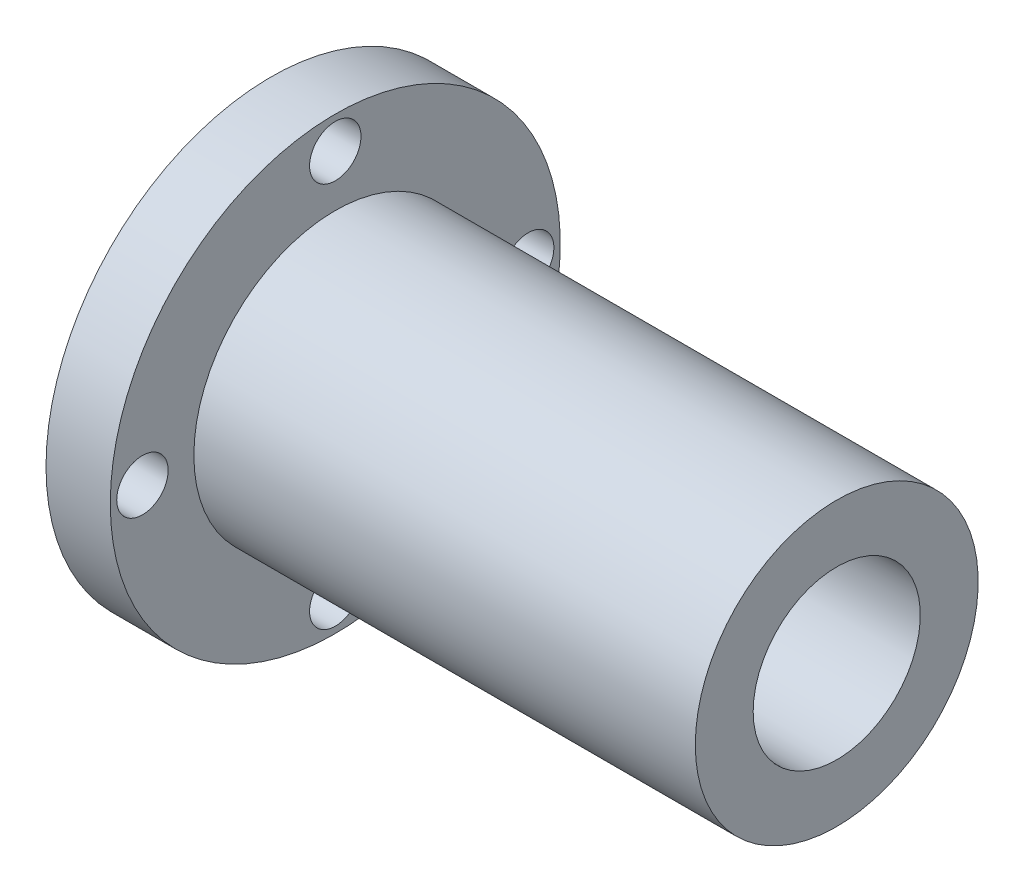
ISO-10303-21;
HEADER;
FILE_DESCRIPTION(('STEP AP214'),'2;1');
FILE_NAME('part.step','',(''),(''),'','','');
FILE_SCHEMA(('AUTOMOTIVE_DESIGN { 1 0 10303 214 1 1 1 1 }'));
ENDSEC;
DATA;
#1=APPLICATION_CONTEXT('core data for automotive mechanical design processes');
#2=APPLICATION_PROTOCOL_DEFINITION('international standard','automotive_design',2000,#1);
#3=PRODUCT_CONTEXT('',#1,'mechanical');
#4=PRODUCT('Part','Part','',(#3));
#5=PRODUCT_RELATED_PRODUCT_CATEGORY('part','',(#4));
#6=PRODUCT_DEFINITION_FORMATION('','',#4);
#7=PRODUCT_DEFINITION_CONTEXT('part definition',#1,'design');
#8=PRODUCT_DEFINITION('design','',#6,#7);
#9=PRODUCT_DEFINITION_SHAPE('','',#8);
#10=(LENGTH_UNIT() NAMED_UNIT(*) SI_UNIT(.MILLI.,.METRE.));
#11=(NAMED_UNIT(*) PLANE_ANGLE_UNIT() SI_UNIT($,.RADIAN.));
#12=(NAMED_UNIT(*) SI_UNIT($,.STERADIAN.) SOLID_ANGLE_UNIT());
#13=UNCERTAINTY_MEASURE_WITH_UNIT(LENGTH_MEASURE(1.E-05),#10,'distance_accuracy_value','');
#14=(GEOMETRIC_REPRESENTATION_CONTEXT(3) GLOBAL_UNCERTAINTY_ASSIGNED_CONTEXT((#13)) GLOBAL_UNIT_ASSIGNED_CONTEXT((#10,
#11,#12)) REPRESENTATION_CONTEXT('',''));
#15=CARTESIAN_POINT('',(0.,0.,0.));
#16=DIRECTION('',(0.,0.,1.));
#17=DIRECTION('',(1.,0.,0.));
#18=AXIS2_PLACEMENT_3D('',#15,#16,#17);
#19=CARTESIAN_POINT('',(0.,0.,0.));
#20=DIRECTION('',(-1.,0.,0.));
#21=DIRECTION('',(0.,0.,1.));
#22=AXIS2_PLACEMENT_3D('',#19,#20,#21);
#23=CYLINDRICAL_SURFACE('',#22,6.5);
#24=CARTESIAN_POINT('',(44.,0.,0.));
#25=DIRECTION('',(-1.,0.,0.));
#26=DIRECTION('',(0.,0.,1.));
#27=AXIS2_PLACEMENT_3D('',#24,#25,#26);
#28=CIRCLE('',#27,6.5);
#29=CARTESIAN_POINT('',(44.,0.,6.5));
#30=VERTEX_POINT('',#29);
#31=EDGE_CURVE('E10',#30,#30,#28,.T.);
#32=ORIENTED_EDGE('',*,*,#31,.F.);
#33=EDGE_LOOP('',(#32));
#34=FACE_BOUND('',#33,.T.);
#35=CARTESIAN_POINT('',(20.,0.,0.));
#36=DIRECTION('',(-1.,0.,0.));
#37=DIRECTION('',(0.,0.,1.));
#38=AXIS2_PLACEMENT_3D('',#35,#36,#37);
#39=CIRCLE('',#38,6.5);
#40=CARTESIAN_POINT('',(20.,0.,6.5));
#41=VERTEX_POINT('',#40);
#42=EDGE_CURVE('E56',#41,#41,#39,.T.);
#43=ORIENTED_EDGE('',*,*,#42,.T.);
#44=EDGE_LOOP('',(#43));
#45=FACE_BOUND('',#44,.T.);
#46=ADVANCED_FACE('F28',(#34,#45),#23,.F.);
#47=CARTESIAN_POINT('',(44.,6.5,0.));
#48=DIRECTION('',(-1.,0.,0.));
#49=DIRECTION('',(0.,0.,1.));
#50=AXIS2_PLACEMENT_3D('',#47,#48,#49);
#51=PLANE('',#50);
#52=CARTESIAN_POINT('',(44.,0.,0.));
#53=DIRECTION('',(-1.,0.,0.));
#54=DIRECTION('',(0.,0.,1.));
#55=AXIS2_PLACEMENT_3D('',#52,#53,#54);
#56=CIRCLE('',#55,11.);
#57=CARTESIAN_POINT('',(44.,0.,11.));
#58=VERTEX_POINT('',#57);
#59=EDGE_CURVE('E34',#58,#58,#56,.T.);
#60=ORIENTED_EDGE('',*,*,#59,.F.);
#61=EDGE_LOOP('',(#60));
#62=FACE_BOUND('',#61,.T.);
#63=ORIENTED_EDGE('',*,*,#31,.T.);
#64=EDGE_LOOP('',(#63));
#65=FACE_BOUND('',#64,.T.);
#66=ADVANCED_FACE('F117',(#62,#65),#51,.F.);
#67=CARTESIAN_POINT('',(0.,0.,0.));
#68=DIRECTION('',(-1.,0.,0.));
#69=DIRECTION('',(0.,0.,1.));
#70=AXIS2_PLACEMENT_3D('',#67,#68,#69);
#71=CYLINDRICAL_SURFACE('',#70,11.);
#72=CARTESIAN_POINT('',(5.,0.,0.));
#73=DIRECTION('',(-1.,0.,0.));
#74=DIRECTION('',(0.,0.,1.));
#75=AXIS2_PLACEMENT_3D('',#72,#73,#74);
#76=CIRCLE('',#75,11.);
#77=CARTESIAN_POINT('',(5.,0.,11.));
#78=VERTEX_POINT('',#77);
#79=EDGE_CURVE('E38',#78,#78,#76,.T.);
#80=ORIENTED_EDGE('',*,*,#79,.F.);
#81=EDGE_LOOP('',(#80));
#82=FACE_BOUND('',#81,.T.);
#83=ORIENTED_EDGE('',*,*,#59,.T.);
#84=EDGE_LOOP('',(#83));
#85=FACE_BOUND('',#84,.T.);
#86=ADVANCED_FACE('F111',(#82,#85),#71,.T.);
#87=CARTESIAN_POINT('',(5.,17.5,0.));
#88=DIRECTION('',(-1.,0.,0.));
#89=DIRECTION('',(0.,0.,1.));
#90=AXIS2_PLACEMENT_3D('',#87,#88,#89);
#91=PLANE('',#90);
#92=CARTESIAN_POINT('',(5.,0.,-15.));
#93=DIRECTION('',(-1.,0.,0.));
#94=DIRECTION('',(0.,0.,1.));
#95=AXIS2_PLACEMENT_3D('',#92,#93,#94);
#96=CIRCLE('',#95,2.);
#97=CARTESIAN_POINT('',(5.,0.,-13.));
#98=VERTEX_POINT('',#97);
#99=EDGE_CURVE('E77',#98,#98,#96,.T.);
#100=ORIENTED_EDGE('',*,*,#99,.T.);
#101=EDGE_LOOP('',(#100));
#102=FACE_BOUND('',#101,.T.);
#103=CARTESIAN_POINT('',(5.,-15.,0.));
#104=DIRECTION('',(-1.,0.,0.));
#105=DIRECTION('',(0.,0.,1.));
#106=AXIS2_PLACEMENT_3D('',#103,#104,#105);
#107=CIRCLE('',#106,2.);
#108=CARTESIAN_POINT('',(5.,-15.,2.));
#109=VERTEX_POINT('',#108);
#110=EDGE_CURVE('E71',#109,#109,#107,.T.);
#111=ORIENTED_EDGE('',*,*,#110,.T.);
#112=EDGE_LOOP('',(#111));
#113=FACE_BOUND('',#112,.T.);
#114=CARTESIAN_POINT('',(5.,0.,15.));
#115=DIRECTION('',(-1.,0.,0.));
#116=DIRECTION('',(0.,0.,1.));
#117=AXIS2_PLACEMENT_3D('',#114,#115,#116);
#118=CIRCLE('',#117,2.);
#119=CARTESIAN_POINT('',(5.,0.,17.));
#120=VERTEX_POINT('',#119);
#121=EDGE_CURVE('E65',#120,#120,#118,.T.);
#122=ORIENTED_EDGE('',*,*,#121,.T.);
#123=EDGE_LOOP('',(#122));
#124=FACE_BOUND('',#123,.T.);
#125=CARTESIAN_POINT('',(5.,15.,0.));
#126=DIRECTION('',(-1.,0.,0.));
#127=DIRECTION('',(0.,0.,1.));
#128=AXIS2_PLACEMENT_3D('',#125,#126,#127);
#129=CIRCLE('',#128,2.);
#130=CARTESIAN_POINT('',(5.,15.,2.));
#131=VERTEX_POINT('',#130);
#132=EDGE_CURVE('E59',#131,#131,#129,.T.);
#133=ORIENTED_EDGE('',*,*,#132,.T.);
#134=EDGE_LOOP('',(#133));
#135=FACE_BOUND('',#134,.T.);
#136=CARTESIAN_POINT('',(5.,0.,0.));
#137=DIRECTION('',(-1.,0.,0.));
#138=DIRECTION('',(0.,0.,1.));
#139=AXIS2_PLACEMENT_3D('',#136,#137,#138);
#140=CIRCLE('',#139,17.5);
#141=CARTESIAN_POINT('',(5.,0.,17.5));
#142=VERTEX_POINT('',#141);
#143=EDGE_CURVE('E42',#142,#142,#140,.T.);
#144=ORIENTED_EDGE('',*,*,#143,.F.);
#145=EDGE_LOOP('',(#144));
#146=FACE_BOUND('',#145,.T.);
#147=ORIENTED_EDGE('',*,*,#79,.T.);
#148=EDGE_LOOP('',(#147));
#149=FACE_BOUND('',#148,.T.);
#150=ADVANCED_FACE('F105',(#102,#113,#124,#135,#146,#149),#91,.F.);
#151=CARTESIAN_POINT('',(0.,0.,0.));
#152=DIRECTION('',(-1.,0.,0.));
#153=DIRECTION('',(0.,0.,1.));
#154=AXIS2_PLACEMENT_3D('',#151,#152,#153);
#155=CYLINDRICAL_SURFACE('',#154,17.5);
#156=CARTESIAN_POINT('',(0.,0.,0.));
#157=DIRECTION('',(-1.,0.,0.));
#158=DIRECTION('',(0.,0.,1.));
#159=AXIS2_PLACEMENT_3D('',#156,#157,#158);
#160=CIRCLE('',#159,17.5);
#161=CARTESIAN_POINT('',(0.,0.,17.5));
#162=VERTEX_POINT('',#161);
#163=EDGE_CURVE('E47',#162,#162,#160,.T.);
#164=ORIENTED_EDGE('',*,*,#163,.F.);
#165=EDGE_LOOP('',(#164));
#166=FACE_BOUND('',#165,.T.);
#167=ORIENTED_EDGE('',*,*,#143,.T.);
#168=EDGE_LOOP('',(#167));
#169=FACE_BOUND('',#168,.T.);
#170=ADVANCED_FACE('F91',(#166,#169),#155,.T.);
#171=CARTESIAN_POINT('',(0.,10.,0.));
#172=DIRECTION('',(1.,0.,0.));
#173=DIRECTION('',(0.,0.,-1.));
#174=AXIS2_PLACEMENT_3D('',#171,#172,#173);
#175=PLANE('',#174);
#176=CARTESIAN_POINT('',(0.,0.,-15.));
#177=DIRECTION('',(-1.,0.,0.));
#178=DIRECTION('',(0.,0.,1.));
#179=AXIS2_PLACEMENT_3D('',#176,#177,#178);
#180=CIRCLE('',#179,2.);
#181=CARTESIAN_POINT('',(0.,0.,-13.));
#182=VERTEX_POINT('',#181);
#183=EDGE_CURVE('E80',#182,#182,#180,.T.);
#184=ORIENTED_EDGE('',*,*,#183,.F.);
#185=EDGE_LOOP('',(#184));
#186=FACE_BOUND('',#185,.T.);
#187=CARTESIAN_POINT('',(0.,-15.,0.));
#188=DIRECTION('',(-1.,0.,0.));
#189=DIRECTION('',(0.,0.,1.));
#190=AXIS2_PLACEMENT_3D('',#187,#188,#189);
#191=CIRCLE('',#190,2.);
#192=CARTESIAN_POINT('',(0.,-15.,2.));
#193=VERTEX_POINT('',#192);
#194=EDGE_CURVE('E74',#193,#193,#191,.T.);
#195=ORIENTED_EDGE('',*,*,#194,.F.);
#196=EDGE_LOOP('',(#195));
#197=FACE_BOUND('',#196,.T.);
#198=CARTESIAN_POINT('',(0.,0.,15.));
#199=DIRECTION('',(-1.,0.,0.));
#200=DIRECTION('',(0.,0.,1.));
#201=AXIS2_PLACEMENT_3D('',#198,#199,#200);
#202=CIRCLE('',#201,2.);
#203=CARTESIAN_POINT('',(0.,0.,17.));
#204=VERTEX_POINT('',#203);
#205=EDGE_CURVE('E68',#204,#204,#202,.T.);
#206=ORIENTED_EDGE('',*,*,#205,.F.);
#207=EDGE_LOOP('',(#206));
#208=FACE_BOUND('',#207,.T.);
#209=CARTESIAN_POINT('',(0.,15.,0.));
#210=DIRECTION('',(-1.,0.,0.));
#211=DIRECTION('',(0.,0.,1.));
#212=AXIS2_PLACEMENT_3D('',#209,#210,#211);
#213=CIRCLE('',#212,2.);
#214=CARTESIAN_POINT('',(0.,15.,2.));
#215=VERTEX_POINT('',#214);
#216=EDGE_CURVE('E62',#215,#215,#213,.T.);
#217=ORIENTED_EDGE('',*,*,#216,.F.);
#218=EDGE_LOOP('',(#217));
#219=FACE_BOUND('',#218,.T.);
#220=CARTESIAN_POINT('',(0.,0.,0.));
#221=DIRECTION('',(-1.,0.,0.));
#222=DIRECTION('',(0.,0.,1.));
#223=AXIS2_PLACEMENT_3D('',#220,#221,#222);
#224=CIRCLE('',#223,10.);
#225=CARTESIAN_POINT('',(0.,0.,10.));
#226=VERTEX_POINT('',#225);
#227=EDGE_CURVE('E50',#226,#226,#224,.T.);
#228=ORIENTED_EDGE('',*,*,#227,.F.);
#229=EDGE_LOOP('',(#228));
#230=FACE_BOUND('',#229,.T.);
#231=ORIENTED_EDGE('',*,*,#163,.T.);
#232=EDGE_LOOP('',(#231));
#233=FACE_BOUND('',#232,.T.);
#234=ADVANCED_FACE('F87',(#186,#197,#208,#219,#230,#233),#175,.F.);
#235=CARTESIAN_POINT('',(0.,0.,0.));
#236=DIRECTION('',(-1.,0.,0.));
#237=DIRECTION('',(0.,0.,1.));
#238=AXIS2_PLACEMENT_3D('',#235,#236,#237);
#239=CYLINDRICAL_SURFACE('',#238,10.);
#240=CARTESIAN_POINT('',(20.,0.,0.));
#241=DIRECTION('',(-1.,0.,0.));
#242=DIRECTION('',(0.,0.,1.));
#243=AXIS2_PLACEMENT_3D('',#240,#241,#242);
#244=CIRCLE('',#243,10.);
#245=CARTESIAN_POINT('',(20.,0.,10.));
#246=VERTEX_POINT('',#245);
#247=EDGE_CURVE('E53',#246,#246,#244,.T.);
#248=ORIENTED_EDGE('',*,*,#247,.F.);
#249=EDGE_LOOP('',(#248));
#250=FACE_BOUND('',#249,.T.);
#251=ORIENTED_EDGE('',*,*,#227,.T.);
#252=EDGE_LOOP('',(#251));
#253=FACE_BOUND('',#252,.T.);
#254=ADVANCED_FACE('F90',(#250,#253),#239,.F.);
#255=CARTESIAN_POINT('',(20.,6.5,0.));
#256=DIRECTION('',(1.,0.,0.));
#257=DIRECTION('',(0.,0.,-1.));
#258=AXIS2_PLACEMENT_3D('',#255,#256,#257);
#259=PLANE('',#258);
#260=ORIENTED_EDGE('',*,*,#42,.F.);
#261=EDGE_LOOP('',(#260));
#262=FACE_BOUND('',#261,.T.);
#263=ORIENTED_EDGE('',*,*,#247,.T.);
#264=EDGE_LOOP('',(#263));
#265=FACE_BOUND('',#264,.T.);
#266=ADVANCED_FACE('F130',(#262,#265),#259,.F.);
#267=CARTESIAN_POINT('',(44.,15.,0.));
#268=DIRECTION('',(-1.,0.,0.));
#269=DIRECTION('',(0.,0.,1.));
#270=AXIS2_PLACEMENT_3D('',#267,#268,#269);
#271=CYLINDRICAL_SURFACE('',#270,2.);
#272=ORIENTED_EDGE('',*,*,#216,.T.);
#273=EDGE_LOOP('',(#272));
#274=FACE_BOUND('',#273,.T.);
#275=ORIENTED_EDGE('',*,*,#132,.F.);
#276=EDGE_LOOP('',(#275));
#277=FACE_BOUND('',#276,.T.);
#278=ADVANCED_FACE('F133',(#274,#277),#271,.F.);
#279=CARTESIAN_POINT('',(44.,0.,15.));
#280=DIRECTION('',(-1.,0.,0.));
#281=DIRECTION('',(0.,0.,1.));
#282=AXIS2_PLACEMENT_3D('',#279,#280,#281);
#283=CYLINDRICAL_SURFACE('',#282,2.);
#284=ORIENTED_EDGE('',*,*,#205,.T.);
#285=EDGE_LOOP('',(#284));
#286=FACE_BOUND('',#285,.T.);
#287=ORIENTED_EDGE('',*,*,#121,.F.);
#288=EDGE_LOOP('',(#287));
#289=FACE_BOUND('',#288,.T.);
#290=ADVANCED_FACE('F145',(#286,#289),#283,.F.);
#291=CARTESIAN_POINT('',(44.,-15.,0.));
#292=DIRECTION('',(-1.,0.,0.));
#293=DIRECTION('',(0.,0.,1.));
#294=AXIS2_PLACEMENT_3D('',#291,#292,#293);
#295=CYLINDRICAL_SURFACE('',#294,2.);
#296=ORIENTED_EDGE('',*,*,#194,.T.);
#297=EDGE_LOOP('',(#296));
#298=FACE_BOUND('',#297,.T.);
#299=ORIENTED_EDGE('',*,*,#110,.F.);
#300=EDGE_LOOP('',(#299));
#301=FACE_BOUND('',#300,.T.);
#302=ADVANCED_FACE('F149',(#298,#301),#295,.F.);
#303=CARTESIAN_POINT('',(44.,0.,-15.));
#304=DIRECTION('',(-1.,0.,0.));
#305=DIRECTION('',(0.,0.,1.));
#306=AXIS2_PLACEMENT_3D('',#303,#304,#305);
#307=CYLINDRICAL_SURFACE('',#306,2.);
#308=ORIENTED_EDGE('',*,*,#183,.T.);
#309=EDGE_LOOP('',(#308));
#310=FACE_BOUND('',#309,.T.);
#311=ORIENTED_EDGE('',*,*,#99,.F.);
#312=EDGE_LOOP('',(#311));
#313=FACE_BOUND('',#312,.T.);
#314=ADVANCED_FACE('F84',(#310,#313),#307,.F.);
#315=CLOSED_SHELL('',(#46,#66,#86,#150,#170,#234,#254,#266,#278,#290,#302,#314));
#316=MANIFOLD_SOLID_BREP('B2',#315);
#317=ADVANCED_BREP_SHAPE_REPRESENTATION('',(#18,#316),#14);
#318=SHAPE_DEFINITION_REPRESENTATION(#9,#317);
ENDSEC;
END-ISO-10303-21;
